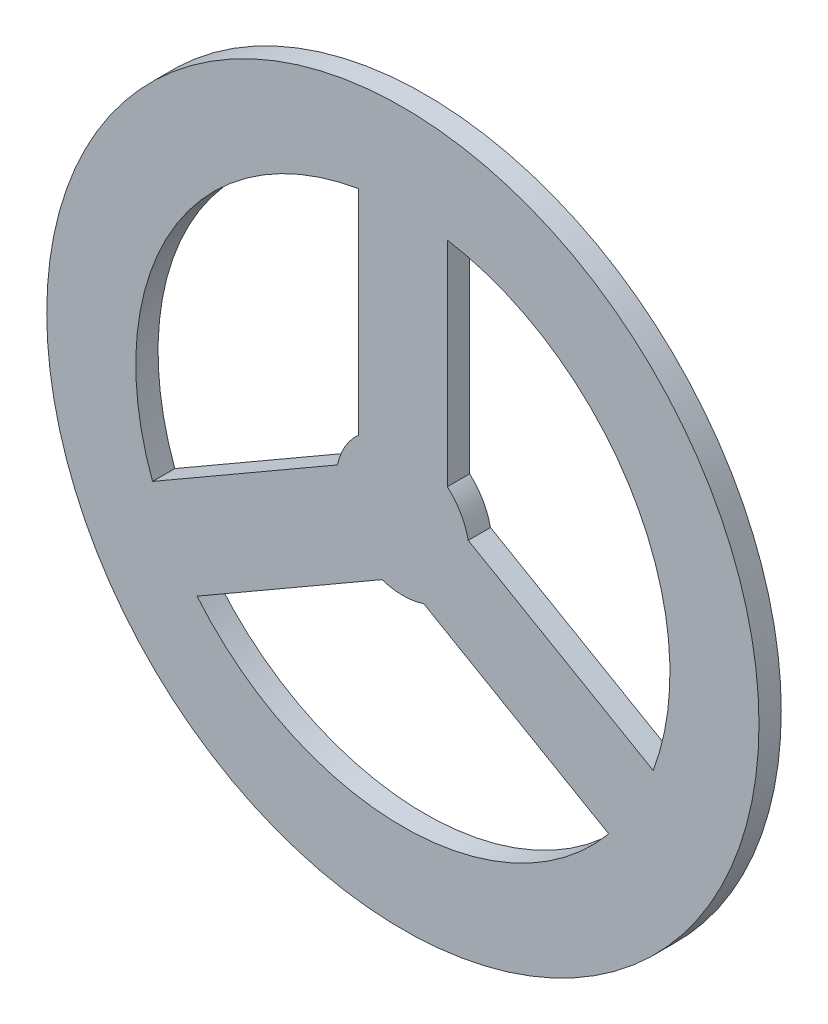
ISO-10303-21;
HEADER;
FILE_DESCRIPTION(('STEP AP214'),'2;1');
FILE_NAME('part.step','',(''),(''),'','','');
FILE_SCHEMA(('AUTOMOTIVE_DESIGN { 1 0 10303 214 1 1 1 1 }'));
ENDSEC;
DATA;
#1=APPLICATION_CONTEXT('core data for automotive mechanical design processes');
#2=APPLICATION_PROTOCOL_DEFINITION('international standard','automotive_design',2000,#1);
#3=PRODUCT_CONTEXT('',#1,'mechanical');
#4=PRODUCT('Part','Part','',(#3));
#5=PRODUCT_RELATED_PRODUCT_CATEGORY('part','',(#4));
#6=PRODUCT_DEFINITION_FORMATION('','',#4);
#7=PRODUCT_DEFINITION_CONTEXT('part definition',#1,'design');
#8=PRODUCT_DEFINITION('design','',#6,#7);
#9=PRODUCT_DEFINITION_SHAPE('','',#8);
#10=(LENGTH_UNIT() NAMED_UNIT(*) SI_UNIT(.MILLI.,.METRE.));
#11=(NAMED_UNIT(*) PLANE_ANGLE_UNIT() SI_UNIT($,.RADIAN.));
#12=(NAMED_UNIT(*) SI_UNIT($,.STERADIAN.) SOLID_ANGLE_UNIT());
#13=UNCERTAINTY_MEASURE_WITH_UNIT(LENGTH_MEASURE(1.E-05),#10,'distance_accuracy_value','');
#14=(GEOMETRIC_REPRESENTATION_CONTEXT(3) GLOBAL_UNCERTAINTY_ASSIGNED_CONTEXT((#13)) GLOBAL_UNIT_ASSIGNED_CONTEXT((#10,
#11,#12)) REPRESENTATION_CONTEXT('',''));
#15=CARTESIAN_POINT('',(0.,0.,0.));
#16=DIRECTION('',(0.,0.,1.));
#17=DIRECTION('',(1.,0.,0.));
#18=AXIS2_PLACEMENT_3D('',#15,#16,#17);
#19=CARTESIAN_POINT('',(0.,0.,4.7625));
#20=DIRECTION('',(0.,0.,1.));
#21=DIRECTION('',(1.,0.,0.));
#22=AXIS2_PLACEMENT_3D('',#19,#20,#21);
#23=PLANE('',#22);
#24=CARTESIAN_POINT('',(0.,0.,4.7625));
#25=DIRECTION('',(0.,0.,1.));
#26=DIRECTION('',(1.,0.,0.));
#27=AXIS2_PLACEMENT_3D('',#24,#25,#26);
#28=CIRCLE('',#27,50.8);
#29=CARTESIAN_POINT('',(50.8,0.,4.7625));
#30=VERTEX_POINT('',#29);
#31=EDGE_CURVE('E11',#30,#30,#28,.T.);
#32=ORIENTED_EDGE('',*,*,#31,.T.);
#33=EDGE_LOOP('',(#32));
#34=FACE_BOUND('',#33,.T.);
#35=DIRECTION('',(0.866025403784436,-0.500000000000004,0.));
#36=VECTOR('',#35,1.);
#37=CARTESIAN_POINT('',(9.32336106210427,1.94950339975024,4.7625));
#38=LINE('',#37,#36);
#39=CARTESIAN_POINT('',(9.32336106210427,1.94950339975024,4.7625));
#40=VERTEX_POINT('',#39);
#41=CARTESIAN_POINT('',(35.7090686819217,-13.2842919973103,4.7625));
#42=VERTEX_POINT('',#41);
#43=EDGE_CURVE('E197',#40,#42,#38,.T.);
#44=ORIENTED_EDGE('',*,*,#43,.F.);
#45=CARTESIAN_POINT('',(0.,0.,4.7625));
#46=DIRECTION('',(0.,0.,-1.));
#47=DIRECTION('',(1.,0.,0.));
#48=AXIS2_PLACEMENT_3D('',#45,#46,#47);
#49=CIRCLE('',#48,9.525);
#50=CARTESIAN_POINT('',(6.34999999999999,7.09951582856184,4.7625));
#51=VERTEX_POINT('',#50);
#52=EDGE_CURVE('E195',#51,#40,#49,.T.);
#53=ORIENTED_EDGE('',*,*,#52,.F.);
#54=DIRECTION('',(0.,-1.,0.));
#55=VECTOR('',#54,1.);
#56=CARTESIAN_POINT('',(6.34999999999999,7.09951582856184,4.7625));
#57=LINE('',#56,#55);
#58=CARTESIAN_POINT('',(6.34999999999999,37.5671066226826,4.7625));
#59=VERTEX_POINT('',#58);
#60=EDGE_CURVE('E203',#59,#51,#57,.T.);
#61=ORIENTED_EDGE('',*,*,#60,.F.);
#62=CARTESIAN_POINT('',(0.,0.,4.7625));
#63=DIRECTION('',(0.,0.,1.));
#64=DIRECTION('',(1.,0.,0.));
#65=AXIS2_PLACEMENT_3D('',#62,#63,#64);
#66=CIRCLE('',#65,38.1);
#67=EDGE_CURVE('E200',#42,#59,#66,.T.);
#68=ORIENTED_EDGE('',*,*,#67,.F.);
#69=EDGE_LOOP('',(#44,#53,#61,#68));
#70=FACE_BOUND('',#69,.T.);
#71=DIRECTION('',(0.,1.,0.));
#72=VECTOR('',#71,1.);
#73=CARTESIAN_POINT('',(-6.35000000000001,7.09951582856184,4.7625));
#74=LINE('',#73,#72);
#75=CARTESIAN_POINT('',(-6.35000000000001,7.09951582856184,4.7625));
#76=VERTEX_POINT('',#75);
#77=CARTESIAN_POINT('',(-6.35000000000001,37.5671066226826,4.7625));
#78=VERTEX_POINT('',#77);
#79=EDGE_CURVE('E166',#76,#78,#74,.T.);
#80=ORIENTED_EDGE('',*,*,#79,.F.);
#81=CARTESIAN_POINT('',(0.,0.,4.7625));
#82=DIRECTION('',(0.,0.,-1.));
#83=DIRECTION('',(1.,0.,0.));
#84=AXIS2_PLACEMENT_3D('',#81,#82,#83);
#85=CIRCLE('',#84,9.525);
#86=CARTESIAN_POINT('',(-9.32336106210427,1.94950339975036,4.7625));
#87=VERTEX_POINT('',#86);
#88=EDGE_CURVE('E164',#87,#76,#85,.T.);
#89=ORIENTED_EDGE('',*,*,#88,.F.);
#90=DIRECTION('',(0.866025403784443,0.499999999999992,0.));
#91=VECTOR('',#90,1.);
#92=CARTESIAN_POINT('',(-9.32336106210427,1.94950339975036,4.7625));
#93=LINE('',#92,#91);
#94=CARTESIAN_POINT('',(-35.7090686819219,-13.2842919973098,4.7625));
#95=VERTEX_POINT('',#94);
#96=EDGE_CURVE('E172',#95,#87,#93,.T.);
#97=ORIENTED_EDGE('',*,*,#96,.F.);
#98=CARTESIAN_POINT('',(0.,0.,4.7625));
#99=DIRECTION('',(0.,0.,1.));
#100=DIRECTION('',(1.,0.,0.));
#101=AXIS2_PLACEMENT_3D('',#98,#99,#100);
#102=CIRCLE('',#101,38.1);
#103=EDGE_CURVE('E169',#78,#95,#102,.T.);
#104=ORIENTED_EDGE('',*,*,#103,.F.);
#105=EDGE_LOOP('',(#80,#89,#97,#104));
#106=FACE_BOUND('',#105,.T.);
#107=DIRECTION('',(-0.866025403784443,-0.499999999999992,0.));
#108=VECTOR('',#107,1.);
#109=CARTESIAN_POINT('',(-2.97336106210437,-9.04901922831207,4.7625));
#110=LINE('',#109,#108);
#111=CARTESIAN_POINT('',(-2.97336106210437,-9.04901922831207,4.7625));
#112=VERTEX_POINT('',#111);
#113=CARTESIAN_POINT('',(-29.359068681922,-24.2828146253722,4.7625));
#114=VERTEX_POINT('',#113);
#115=EDGE_CURVE('E136',#112,#114,#110,.T.);
#116=ORIENTED_EDGE('',*,*,#115,.F.);
#117=CARTESIAN_POINT('',(0.,0.,4.7625));
#118=DIRECTION('',(0.,0.,-1.));
#119=DIRECTION('',(1.,0.,0.));
#120=AXIS2_PLACEMENT_3D('',#117,#118,#119);
#121=CIRCLE('',#120,9.525);
#122=CARTESIAN_POINT('',(2.97336106210422,-9.04901922831211,4.7625));
#123=VERTEX_POINT('',#122);
#124=EDGE_CURVE('E128',#123,#112,#121,.T.);
#125=ORIENTED_EDGE('',*,*,#124,.F.);
#126=DIRECTION('',(-0.866025403784436,0.500000000000004,0.));
#127=VECTOR('',#126,1.);
#128=CARTESIAN_POINT('',(2.97336106210422,-9.04901922831211,4.7625));
#129=LINE('',#128,#127);
#130=CARTESIAN_POINT('',(29.3590686819216,-24.2828146253726,4.7625));
#131=VERTEX_POINT('',#130);
#132=EDGE_CURVE('E150',#131,#123,#129,.T.);
#133=ORIENTED_EDGE('',*,*,#132,.F.);
#134=CARTESIAN_POINT('',(0.,0.,4.7625));
#135=DIRECTION('',(0.,0.,1.));
#136=DIRECTION('',(1.,0.,0.));
#137=AXIS2_PLACEMENT_3D('',#134,#135,#136);
#138=CIRCLE('',#137,38.1);
#139=EDGE_CURVE('E148',#114,#131,#138,.T.);
#140=ORIENTED_EDGE('',*,*,#139,.F.);
#141=EDGE_LOOP('',(#116,#125,#133,#140));
#142=FACE_BOUND('',#141,.T.);
#143=ADVANCED_FACE('F39',(#34,#70,#106,#142),#23,.T.);
#144=CARTESIAN_POINT('',(0.,0.,1.5875));
#145=DIRECTION('',(0.,0.,1.));
#146=DIRECTION('',(1.,0.,0.));
#147=AXIS2_PLACEMENT_3D('',#144,#145,#146);
#148=PLANE('',#147);
#149=CARTESIAN_POINT('',(0.,0.,1.5875));
#150=DIRECTION('',(0.,0.,-1.));
#151=DIRECTION('',(1.,0.,0.));
#152=AXIS2_PLACEMENT_3D('',#149,#150,#151);
#153=CIRCLE('',#152,9.525);
#154=CARTESIAN_POINT('',(-9.32336106210427,1.94950339975036,1.5875));
#155=VERTEX_POINT('',#154);
#156=CARTESIAN_POINT('',(-6.35000000000001,7.09951582856184,1.5875));
#157=VERTEX_POINT('',#156);
#158=EDGE_CURVE('E144',#155,#157,#153,.T.);
#159=ORIENTED_EDGE('',*,*,#158,.T.);
#160=DIRECTION('',(0.,1.,0.));
#161=VECTOR('',#160,1.);
#162=CARTESIAN_POINT('',(-6.35000000000001,7.09951582856184,1.5875));
#163=LINE('',#162,#161);
#164=CARTESIAN_POINT('',(-6.35000000000001,37.5671066226826,1.5875));
#165=VERTEX_POINT('',#164);
#166=EDGE_CURVE('E177',#157,#165,#163,.T.);
#167=ORIENTED_EDGE('',*,*,#166,.T.);
#168=CARTESIAN_POINT('',(0.,0.,1.5875));
#169=DIRECTION('',(0.,0.,1.));
#170=DIRECTION('',(1.,0.,0.));
#171=AXIS2_PLACEMENT_3D('',#168,#169,#170);
#172=CIRCLE('',#171,38.1);
#173=CARTESIAN_POINT('',(-35.7090686819219,-13.2842919973097,1.5875));
#174=VERTEX_POINT('',#173);
#175=EDGE_CURVE('E180',#165,#174,#172,.T.);
#176=ORIENTED_EDGE('',*,*,#175,.T.);
#177=DIRECTION('',(0.866025403784443,0.499999999999992,0.));
#178=VECTOR('',#177,1.);
#179=CARTESIAN_POINT('',(-9.32336106210427,1.94950339975036,1.5875));
#180=LINE('',#179,#178);
#181=EDGE_CURVE('E167',#174,#155,#180,.T.);
#182=ORIENTED_EDGE('',*,*,#181,.T.);
#183=EDGE_LOOP('',(#159,#167,#176,#182));
#184=FACE_BOUND('',#183,.T.);
#185=CARTESIAN_POINT('',(0.,0.,1.5875));
#186=DIRECTION('',(0.,0.,1.));
#187=DIRECTION('',(1.,0.,0.));
#188=AXIS2_PLACEMENT_3D('',#185,#186,#187);
#189=CIRCLE('',#188,50.8);
#190=CARTESIAN_POINT('',(50.8,0.,1.5875));
#191=VERTEX_POINT('',#190);
#192=EDGE_CURVE('E43',#191,#191,#189,.T.);
#193=ORIENTED_EDGE('',*,*,#192,.F.);
#194=EDGE_LOOP('',(#193));
#195=FACE_BOUND('',#194,.T.);
#196=CARTESIAN_POINT('',(0.,0.,1.5875));
#197=DIRECTION('',(0.,0.,-1.));
#198=DIRECTION('',(1.,0.,0.));
#199=AXIS2_PLACEMENT_3D('',#196,#197,#198);
#200=CIRCLE('',#199,9.525);
#201=CARTESIAN_POINT('',(6.34999999999999,7.09951582856184,1.5875));
#202=VERTEX_POINT('',#201);
#203=CARTESIAN_POINT('',(9.32336106210427,1.94950339975024,1.5875));
#204=VERTEX_POINT('',#203);
#205=EDGE_CURVE('E194',#202,#204,#200,.T.);
#206=ORIENTED_EDGE('',*,*,#205,.T.);
#207=DIRECTION('',(0.866025403784436,-0.500000000000004,0.));
#208=VECTOR('',#207,1.);
#209=CARTESIAN_POINT('',(9.32336106210427,1.94950339975024,1.5875));
#210=LINE('',#209,#208);
#211=CARTESIAN_POINT('',(35.7090686819217,-13.2842919973103,1.5875));
#212=VERTEX_POINT('',#211);
#213=EDGE_CURVE('E208',#204,#212,#210,.T.);
#214=ORIENTED_EDGE('',*,*,#213,.T.);
#215=CARTESIAN_POINT('',(0.,0.,1.5875));
#216=DIRECTION('',(0.,0.,1.));
#217=DIRECTION('',(1.,0.,0.));
#218=AXIS2_PLACEMENT_3D('',#215,#216,#217);
#219=CIRCLE('',#218,38.1);
#220=CARTESIAN_POINT('',(6.34999999999999,37.5671066226826,1.5875));
#221=VERTEX_POINT('',#220);
#222=EDGE_CURVE('E211',#212,#221,#219,.T.);
#223=ORIENTED_EDGE('',*,*,#222,.T.);
#224=DIRECTION('',(0.,-1.,0.));
#225=VECTOR('',#224,1.);
#226=CARTESIAN_POINT('',(6.34999999999999,7.09951582856184,1.5875));
#227=LINE('',#226,#225);
#228=EDGE_CURVE('E198',#221,#202,#227,.T.);
#229=ORIENTED_EDGE('',*,*,#228,.T.);
#230=EDGE_LOOP('',(#206,#214,#223,#229));
#231=FACE_BOUND('',#230,.T.);
#232=CARTESIAN_POINT('',(0.,0.,1.5875));
#233=DIRECTION('',(0.,0.,-1.));
#234=DIRECTION('',(1.,0.,0.));
#235=AXIS2_PLACEMENT_3D('',#232,#233,#234);
#236=CIRCLE('',#235,9.525);
#237=CARTESIAN_POINT('',(2.97336106210422,-9.04901922831211,1.5875));
#238=VERTEX_POINT('',#237);
#239=CARTESIAN_POINT('',(-2.97336106210437,-9.04901922831207,1.5875));
#240=VERTEX_POINT('',#239);
#241=EDGE_CURVE('E62',#238,#240,#236,.T.);
#242=ORIENTED_EDGE('',*,*,#241,.T.);
#243=DIRECTION('',(-0.866025403784443,-0.499999999999992,0.));
#244=VECTOR('',#243,1.);
#245=CARTESIAN_POINT('',(-2.97336106210437,-9.04901922831207,1.5875));
#246=LINE('',#245,#244);
#247=CARTESIAN_POINT('',(-29.359068681922,-24.2828146253722,1.5875));
#248=VERTEX_POINT('',#247);
#249=EDGE_CURVE('E143',#240,#248,#246,.T.);
#250=ORIENTED_EDGE('',*,*,#249,.T.);
#251=CARTESIAN_POINT('',(0.,0.,1.5875));
#252=DIRECTION('',(0.,0.,1.));
#253=DIRECTION('',(1.,0.,0.));
#254=AXIS2_PLACEMENT_3D('',#251,#252,#253);
#255=CIRCLE('',#254,38.1);
#256=CARTESIAN_POINT('',(29.3590686819216,-24.2828146253726,1.5875));
#257=VERTEX_POINT('',#256);
#258=EDGE_CURVE('E156',#248,#257,#255,.T.);
#259=ORIENTED_EDGE('',*,*,#258,.T.);
#260=DIRECTION('',(-0.866025403784436,0.500000000000004,0.));
#261=VECTOR('',#260,1.);
#262=CARTESIAN_POINT('',(2.97336106210422,-9.04901922831211,1.5875));
#263=LINE('',#262,#261);
#264=EDGE_CURVE('E137',#257,#238,#263,.T.);
#265=ORIENTED_EDGE('',*,*,#264,.T.);
#266=EDGE_LOOP('',(#242,#250,#259,#265));
#267=FACE_BOUND('',#266,.T.);
#268=ADVANCED_FACE('F230',(#184,#195,#231,#267),#148,.F.);
#269=CARTESIAN_POINT('',(0.,0.,4.7625));
#270=DIRECTION('',(0.,0.,-1.));
#271=DIRECTION('',(-1.,0.,0.));
#272=AXIS2_PLACEMENT_3D('',#269,#270,#271);
#273=CYLINDRICAL_SURFACE('',#272,50.8);
#274=ORIENTED_EDGE('',*,*,#31,.F.);
#275=EDGE_LOOP('',(#274));
#276=FACE_BOUND('',#275,.T.);
#277=ORIENTED_EDGE('',*,*,#192,.T.);
#278=EDGE_LOOP('',(#277));
#279=FACE_BOUND('',#278,.T.);
#280=ADVANCED_FACE('F41',(#276,#279),#273,.T.);
#281=CARTESIAN_POINT('',(0.,0.,4.7625));
#282=DIRECTION('',(0.,0.,-1.));
#283=DIRECTION('',(-1.,0.,0.));
#284=AXIS2_PLACEMENT_3D('',#281,#282,#283);
#285=CYLINDRICAL_SURFACE('',#284,9.525);
#286=ORIENTED_EDGE('',*,*,#205,.F.);
#287=DIRECTION('',(0.,0.,-1.));
#288=VECTOR('',#287,1.);
#289=CARTESIAN_POINT('',(6.34999999999999,7.09951582856184,4.7625));
#290=LINE('',#289,#288);
#291=EDGE_CURVE('E205',#51,#202,#290,.T.);
#292=ORIENTED_EDGE('',*,*,#291,.F.);
#293=ORIENTED_EDGE('',*,*,#52,.T.);
#294=DIRECTION('',(0.,0.,-1.));
#295=VECTOR('',#294,1.);
#296=CARTESIAN_POINT('',(9.32336106210427,1.94950339975024,4.7625));
#297=LINE('',#296,#295);
#298=EDGE_CURVE('E222',#40,#204,#297,.T.);
#299=ORIENTED_EDGE('',*,*,#298,.T.);
#300=EDGE_LOOP('',(#286,#292,#293,#299));
#301=FACE_BOUND('',#300,.T.);
#302=ADVANCED_FACE('F252',(#301),#285,.T.);
#303=CARTESIAN_POINT('',(9.32336106210427,1.94950339975024,4.7625));
#304=DIRECTION('',(0.500000000000004,0.866025403784436,0.));
#305=DIRECTION('',(-0.866025403784436,0.500000000000004,0.));
#306=AXIS2_PLACEMENT_3D('',#303,#304,#305);
#307=PLANE('',#306);
#308=ORIENTED_EDGE('',*,*,#213,.F.);
#309=ORIENTED_EDGE('',*,*,#298,.F.);
#310=ORIENTED_EDGE('',*,*,#43,.T.);
#311=DIRECTION('',(0.,0.,-1.));
#312=VECTOR('',#311,1.);
#313=CARTESIAN_POINT('',(35.7090686819217,-13.2842919973103,4.7625));
#314=LINE('',#313,#312);
#315=EDGE_CURVE('E220',#42,#212,#314,.T.);
#316=ORIENTED_EDGE('',*,*,#315,.T.);
#317=EDGE_LOOP('',(#308,#309,#310,#316));
#318=FACE_BOUND('',#317,.T.);
#319=ADVANCED_FACE('F255',(#318),#307,.T.);
#320=CARTESIAN_POINT('',(0.,0.,4.7625));
#321=DIRECTION('',(0.,0.,-1.));
#322=DIRECTION('',(-1.,0.,0.));
#323=AXIS2_PLACEMENT_3D('',#320,#321,#322);
#324=CYLINDRICAL_SURFACE('',#323,38.1);
#325=ORIENTED_EDGE('',*,*,#222,.F.);
#326=ORIENTED_EDGE('',*,*,#315,.F.);
#327=ORIENTED_EDGE('',*,*,#67,.T.);
#328=DIRECTION('',(0.,0.,-1.));
#329=VECTOR('',#328,1.);
#330=CARTESIAN_POINT('',(6.34999999999999,37.5671066226826,4.7625));
#331=LINE('',#330,#329);
#332=EDGE_CURVE('E218',#59,#221,#331,.T.);
#333=ORIENTED_EDGE('',*,*,#332,.T.);
#334=EDGE_LOOP('',(#325,#326,#327,#333));
#335=FACE_BOUND('',#334,.T.);
#336=ADVANCED_FACE('F258',(#335),#324,.F.);
#337=CARTESIAN_POINT('',(6.34999999999999,7.09951582856184,4.7625));
#338=DIRECTION('',(1.,0.,0.));
#339=DIRECTION('',(0.,0.,-1.));
#340=AXIS2_PLACEMENT_3D('',#337,#338,#339);
#341=PLANE('',#340);
#342=ORIENTED_EDGE('',*,*,#228,.F.);
#343=ORIENTED_EDGE('',*,*,#332,.F.);
#344=ORIENTED_EDGE('',*,*,#60,.T.);
#345=ORIENTED_EDGE('',*,*,#291,.T.);
#346=EDGE_LOOP('',(#342,#343,#344,#345));
#347=FACE_BOUND('',#346,.T.);
#348=ADVANCED_FACE('F262',(#347),#341,.T.);
#349=CARTESIAN_POINT('',(0.,0.,4.7625));
#350=DIRECTION('',(0.,0.,-1.));
#351=DIRECTION('',(-1.,0.,0.));
#352=AXIS2_PLACEMENT_3D('',#349,#350,#351);
#353=CYLINDRICAL_SURFACE('',#352,9.525);
#354=ORIENTED_EDGE('',*,*,#158,.F.);
#355=DIRECTION('',(0.,0.,-1.));
#356=VECTOR('',#355,1.);
#357=CARTESIAN_POINT('',(-9.32336106210427,1.94950339975036,4.7625));
#358=LINE('',#357,#356);
#359=EDGE_CURVE('E174',#87,#155,#358,.T.);
#360=ORIENTED_EDGE('',*,*,#359,.F.);
#361=ORIENTED_EDGE('',*,*,#88,.T.);
#362=DIRECTION('',(0.,0.,-1.));
#363=VECTOR('',#362,1.);
#364=CARTESIAN_POINT('',(-6.35000000000001,7.09951582856184,4.7625));
#365=LINE('',#364,#363);
#366=EDGE_CURVE('E191',#76,#157,#365,.T.);
#367=ORIENTED_EDGE('',*,*,#366,.T.);
#368=EDGE_LOOP('',(#354,#360,#361,#367));
#369=FACE_BOUND('',#368,.T.);
#370=ADVANCED_FACE('F266',(#369),#353,.T.);
#371=CARTESIAN_POINT('',(-6.35000000000001,7.09951582856184,4.7625));
#372=DIRECTION('',(-1.,0.,0.));
#373=DIRECTION('',(0.,0.,1.));
#374=AXIS2_PLACEMENT_3D('',#371,#372,#373);
#375=PLANE('',#374);
#376=ORIENTED_EDGE('',*,*,#166,.F.);
#377=ORIENTED_EDGE('',*,*,#366,.F.);
#378=ORIENTED_EDGE('',*,*,#79,.T.);
#379=DIRECTION('',(0.,0.,-1.));
#380=VECTOR('',#379,1.);
#381=CARTESIAN_POINT('',(-6.35000000000001,37.5671066226826,4.7625));
#382=LINE('',#381,#380);
#383=EDGE_CURVE('E189',#78,#165,#382,.T.);
#384=ORIENTED_EDGE('',*,*,#383,.T.);
#385=EDGE_LOOP('',(#376,#377,#378,#384));
#386=FACE_BOUND('',#385,.T.);
#387=ADVANCED_FACE('F270',(#386),#375,.T.);
#388=CARTESIAN_POINT('',(0.,0.,4.7625));
#389=DIRECTION('',(0.,0.,-1.));
#390=DIRECTION('',(-1.,0.,0.));
#391=AXIS2_PLACEMENT_3D('',#388,#389,#390);
#392=CYLINDRICAL_SURFACE('',#391,38.1);
#393=ORIENTED_EDGE('',*,*,#175,.F.);
#394=ORIENTED_EDGE('',*,*,#383,.F.);
#395=ORIENTED_EDGE('',*,*,#103,.T.);
#396=DIRECTION('',(0.,0.,-1.));
#397=VECTOR('',#396,1.);
#398=CARTESIAN_POINT('',(-35.7090686819219,-13.2842919973097,4.7625));
#399=LINE('',#398,#397);
#400=EDGE_CURVE('E187',#95,#174,#399,.T.);
#401=ORIENTED_EDGE('',*,*,#400,.T.);
#402=EDGE_LOOP('',(#393,#394,#395,#401));
#403=FACE_BOUND('',#402,.T.);
#404=ADVANCED_FACE('F274',(#403),#392,.F.);
#405=CARTESIAN_POINT('',(-9.32336106210427,1.94950339975036,4.7625));
#406=DIRECTION('',(-0.499999999999992,0.866025403784443,0.));
#407=DIRECTION('',(-0.866025403784443,-0.499999999999992,0.));
#408=AXIS2_PLACEMENT_3D('',#405,#406,#407);
#409=PLANE('',#408);
#410=ORIENTED_EDGE('',*,*,#181,.F.);
#411=ORIENTED_EDGE('',*,*,#400,.F.);
#412=ORIENTED_EDGE('',*,*,#96,.T.);
#413=ORIENTED_EDGE('',*,*,#359,.T.);
#414=EDGE_LOOP('',(#410,#411,#412,#413));
#415=FACE_BOUND('',#414,.T.);
#416=ADVANCED_FACE('F278',(#415),#409,.T.);
#417=CARTESIAN_POINT('',(0.,0.,4.7625));
#418=DIRECTION('',(0.,0.,-1.));
#419=DIRECTION('',(-1.,0.,0.));
#420=AXIS2_PLACEMENT_3D('',#417,#418,#419);
#421=CYLINDRICAL_SURFACE('',#420,9.525);
#422=ORIENTED_EDGE('',*,*,#241,.F.);
#423=DIRECTION('',(0.,0.,-1.));
#424=VECTOR('',#423,1.);
#425=CARTESIAN_POINT('',(2.97336106210422,-9.04901922831211,4.7625));
#426=LINE('',#425,#424);
#427=EDGE_CURVE('E132',#123,#238,#426,.T.);
#428=ORIENTED_EDGE('',*,*,#427,.F.);
#429=ORIENTED_EDGE('',*,*,#124,.T.);
#430=DIRECTION('',(0.,0.,-1.));
#431=VECTOR('',#430,1.);
#432=CARTESIAN_POINT('',(-2.97336106210437,-9.04901922831207,4.7625));
#433=LINE('',#432,#431);
#434=EDGE_CURVE('E131',#112,#240,#433,.T.);
#435=ORIENTED_EDGE('',*,*,#434,.T.);
#436=EDGE_LOOP('',(#422,#428,#429,#435));
#437=FACE_BOUND('',#436,.T.);
#438=ADVANCED_FACE('F130',(#437),#421,.T.);
#439=CARTESIAN_POINT('',(-2.97336106210437,-9.04901922831207,4.7625));
#440=DIRECTION('',(0.499999999999992,-0.866025403784443,0.));
#441=DIRECTION('',(0.866025403784443,0.499999999999992,0.));
#442=AXIS2_PLACEMENT_3D('',#439,#440,#441);
#443=PLANE('',#442);
#444=ORIENTED_EDGE('',*,*,#249,.F.);
#445=ORIENTED_EDGE('',*,*,#434,.F.);
#446=ORIENTED_EDGE('',*,*,#115,.T.);
#447=DIRECTION('',(0.,0.,-1.));
#448=VECTOR('',#447,1.);
#449=CARTESIAN_POINT('',(-29.359068681922,-24.2828146253722,4.7625));
#450=LINE('',#449,#448);
#451=EDGE_CURVE('E145',#114,#248,#450,.T.);
#452=ORIENTED_EDGE('',*,*,#451,.T.);
#453=EDGE_LOOP('',(#444,#445,#446,#452));
#454=FACE_BOUND('',#453,.T.);
#455=ADVANCED_FACE('F140',(#454),#443,.T.);
#456=CARTESIAN_POINT('',(0.,0.,4.7625));
#457=DIRECTION('',(0.,0.,-1.));
#458=DIRECTION('',(-1.,0.,0.));
#459=AXIS2_PLACEMENT_3D('',#456,#457,#458);
#460=CYLINDRICAL_SURFACE('',#459,38.1);
#461=ORIENTED_EDGE('',*,*,#258,.F.);
#462=ORIENTED_EDGE('',*,*,#451,.F.);
#463=ORIENTED_EDGE('',*,*,#139,.T.);
#464=DIRECTION('',(0.,0.,-1.));
#465=VECTOR('',#464,1.);
#466=CARTESIAN_POINT('',(29.3590686819216,-24.2828146253726,4.7625));
#467=LINE('',#466,#465);
#468=EDGE_CURVE('E54',#131,#257,#467,.T.);
#469=ORIENTED_EDGE('',*,*,#468,.T.);
#470=EDGE_LOOP('',(#461,#462,#463,#469));
#471=FACE_BOUND('',#470,.T.);
#472=ADVANCED_FACE('F238',(#471),#460,.F.);
#473=CARTESIAN_POINT('',(2.97336106210422,-9.04901922831211,4.7625));
#474=DIRECTION('',(-0.500000000000004,-0.866025403784436,0.));
#475=DIRECTION('',(0.866025403784436,-0.500000000000004,0.));
#476=AXIS2_PLACEMENT_3D('',#473,#474,#475);
#477=PLANE('',#476);
#478=ORIENTED_EDGE('',*,*,#264,.F.);
#479=ORIENTED_EDGE('',*,*,#468,.F.);
#480=ORIENTED_EDGE('',*,*,#132,.T.);
#481=ORIENTED_EDGE('',*,*,#427,.T.);
#482=EDGE_LOOP('',(#478,#479,#480,#481));
#483=FACE_BOUND('',#482,.T.);
#484=ADVANCED_FACE('F236',(#483),#477,.T.);
#485=CLOSED_SHELL('',(#143,#268,#280,#302,#319,#336,#348,#370,#387,#404,#416,#438,#455,#472,#484));
#486=MANIFOLD_SOLID_BREP('B2',#485);
#487=ADVANCED_BREP_SHAPE_REPRESENTATION('',(#18,#486),#14);
#488=SHAPE_DEFINITION_REPRESENTATION(#9,#487);
ENDSEC;
END-ISO-10303-21;
